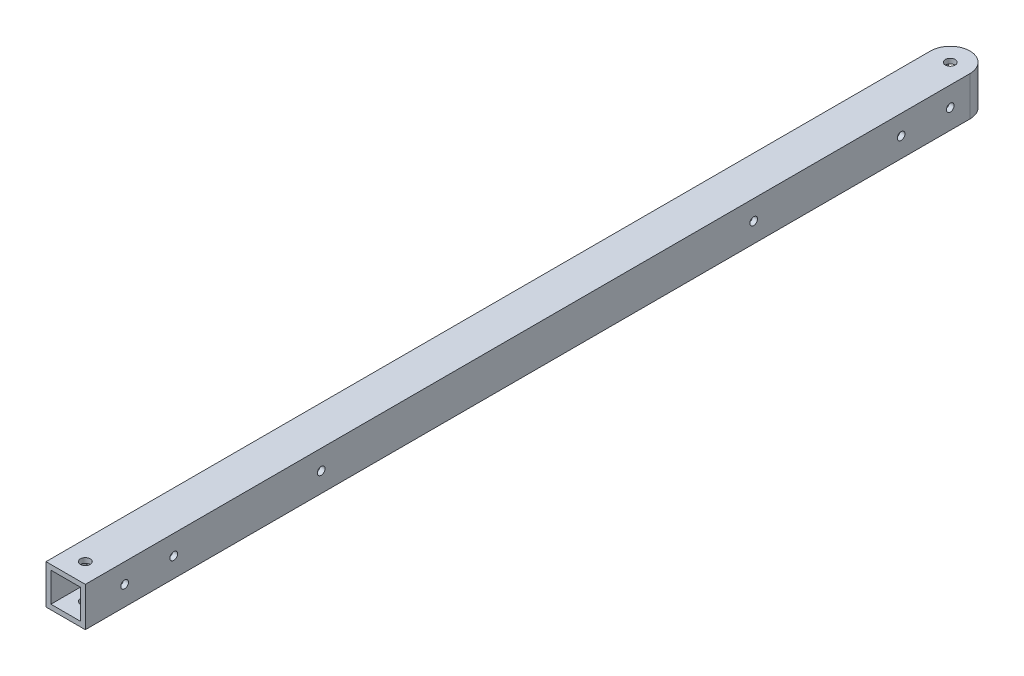
ISO-10303-21;
HEADER;
FILE_DESCRIPTION(('STEP AP214'),'2;1');
FILE_NAME('part.step','',(''),(''),'','','');
FILE_SCHEMA(('AUTOMOTIVE_DESIGN { 1 0 10303 214 1 1 1 1 }'));
ENDSEC;
DATA;
#1=APPLICATION_CONTEXT('core data for automotive mechanical design processes');
#2=APPLICATION_PROTOCOL_DEFINITION('international standard','automotive_design',2000,#1);
#3=PRODUCT_CONTEXT('',#1,'mechanical');
#4=PRODUCT('Part','Part','',(#3));
#5=PRODUCT_RELATED_PRODUCT_CATEGORY('part','',(#4));
#6=PRODUCT_DEFINITION_FORMATION('','',#4);
#7=PRODUCT_DEFINITION_CONTEXT('part definition',#1,'design');
#8=PRODUCT_DEFINITION('design','',#6,#7);
#9=PRODUCT_DEFINITION_SHAPE('','',#8);
#10=(LENGTH_UNIT() NAMED_UNIT(*) SI_UNIT(.MILLI.,.METRE.));
#11=(NAMED_UNIT(*) PLANE_ANGLE_UNIT() SI_UNIT($,.RADIAN.));
#12=(NAMED_UNIT(*) SI_UNIT($,.STERADIAN.) SOLID_ANGLE_UNIT());
#13=UNCERTAINTY_MEASURE_WITH_UNIT(LENGTH_MEASURE(1.E-05),#10,'distance_accuracy_value','');
#14=(GEOMETRIC_REPRESENTATION_CONTEXT(3) GLOBAL_UNCERTAINTY_ASSIGNED_CONTEXT((#13)) GLOBAL_UNIT_ASSIGNED_CONTEXT((#10,
#11,#12)) REPRESENTATION_CONTEXT('',''));
#15=CARTESIAN_POINT('',(0.,0.,0.));
#16=DIRECTION('',(0.,0.,1.));
#17=DIRECTION('',(1.,0.,0.));
#18=AXIS2_PLACEMENT_3D('',#15,#16,#17);
#19=CARTESIAN_POINT('',(12.7,-12.7,292.1));
#20=DIRECTION('',(-1.,0.,0.));
#21=DIRECTION('',(0.,0.,1.));
#22=AXIS2_PLACEMENT_3D('',#19,#20,#21);
#23=PLANE('',#22);
#24=CARTESIAN_POINT('',(12.7,0.,234.94999999939));
#25=DIRECTION('',(-1.,0.,0.));
#26=DIRECTION('',(0.,0.,1.));
#27=AXIS2_PLACEMENT_3D('',#24,#25,#26);
#28=CIRCLE('',#27,2.4892);
#29=CARTESIAN_POINT('',(12.7,0.,237.43919999939));
#30=VERTEX_POINT('',#29);
#31=EDGE_CURVE('E242',#30,#30,#28,.T.);
#32=ORIENTED_EDGE('',*,*,#31,.T.);
#33=EDGE_LOOP('',(#32));
#34=FACE_BOUND('',#33,.T.);
#35=CARTESIAN_POINT('',(12.7,0.,139.7));
#36=DIRECTION('',(-1.,0.,0.));
#37=DIRECTION('',(0.,0.,1.));
#38=AXIS2_PLACEMENT_3D('',#35,#36,#37);
#39=CIRCLE('',#38,2.4892);
#40=CARTESIAN_POINT('',(12.7,0.,142.1892));
#41=VERTEX_POINT('',#40);
#42=EDGE_CURVE('E236',#41,#41,#39,.T.);
#43=ORIENTED_EDGE('',*,*,#42,.T.);
#44=EDGE_LOOP('',(#43));
#45=FACE_BOUND('',#44,.T.);
#46=CARTESIAN_POINT('',(12.7,0.,266.7));
#47=DIRECTION('',(-1.,0.,0.));
#48=DIRECTION('',(0.,0.,1.));
#49=AXIS2_PLACEMENT_3D('',#46,#47,#48);
#50=CIRCLE('',#49,2.48920000000001);
#51=CARTESIAN_POINT('',(12.7,0.,269.1892));
#52=VERTEX_POINT('',#51);
#53=EDGE_CURVE('E153',#52,#52,#50,.T.);
#54=ORIENTED_EDGE('',*,*,#53,.T.);
#55=EDGE_LOOP('',(#54));
#56=FACE_BOUND('',#55,.T.);
#57=CARTESIAN_POINT('',(12.7,0.,-234.94999999939));
#58=DIRECTION('',(1.,0.,0.));
#59=DIRECTION('',(0.,0.,-1.));
#60=AXIS2_PLACEMENT_3D('',#57,#58,#59);
#61=CIRCLE('',#60,2.4892);
#62=CARTESIAN_POINT('',(12.7,0.,-237.43919999939));
#63=VERTEX_POINT('',#62);
#64=EDGE_CURVE('E219',#63,#63,#61,.T.);
#65=ORIENTED_EDGE('',*,*,#64,.F.);
#66=EDGE_LOOP('',(#65));
#67=FACE_BOUND('',#66,.T.);
#68=CARTESIAN_POINT('',(12.7,0.,-139.7));
#69=DIRECTION('',(1.,0.,0.));
#70=DIRECTION('',(0.,0.,-1.));
#71=AXIS2_PLACEMENT_3D('',#68,#69,#70);
#72=CIRCLE('',#71,2.4892);
#73=CARTESIAN_POINT('',(12.7,0.,-142.1892));
#74=VERTEX_POINT('',#73);
#75=EDGE_CURVE('E213',#74,#74,#72,.T.);
#76=ORIENTED_EDGE('',*,*,#75,.F.);
#77=EDGE_LOOP('',(#76));
#78=FACE_BOUND('',#77,.T.);
#79=CARTESIAN_POINT('',(12.7,0.,-266.7));
#80=DIRECTION('',(1.,0.,0.));
#81=DIRECTION('',(0.,0.,-1.));
#82=AXIS2_PLACEMENT_3D('',#79,#80,#81);
#83=CIRCLE('',#82,2.48920000000001);
#84=CARTESIAN_POINT('',(12.7,0.,-269.1892));
#85=VERTEX_POINT('',#84);
#86=EDGE_CURVE('E166',#85,#85,#83,.T.);
#87=ORIENTED_EDGE('',*,*,#86,.F.);
#88=EDGE_LOOP('',(#87));
#89=FACE_BOUND('',#88,.T.);
#90=DIRECTION('',(0.,-1.,0.));
#91=VECTOR('',#90,1.);
#92=CARTESIAN_POINT('',(12.7,12.7,-279.4));
#93=LINE('',#92,#91);
#94=CARTESIAN_POINT('',(12.7,12.7,-279.4));
#95=VERTEX_POINT('',#94);
#96=CARTESIAN_POINT('',(12.7,-12.7,-279.4));
#97=VERTEX_POINT('',#96);
#98=EDGE_CURVE('E124',#95,#97,#93,.T.);
#99=ORIENTED_EDGE('',*,*,#98,.F.);
#100=DIRECTION('',(0.,0.,-1.));
#101=VECTOR('',#100,1.);
#102=CARTESIAN_POINT('',(12.7,12.7,292.1));
#103=LINE('',#102,#101);
#104=CARTESIAN_POINT('',(12.7,12.7,292.1));
#105=VERTEX_POINT('',#104);
#106=EDGE_CURVE('E64',#105,#95,#103,.T.);
#107=ORIENTED_EDGE('',*,*,#106,.F.);
#108=DIRECTION('',(0.,1.,0.));
#109=VECTOR('',#108,1.);
#110=CARTESIAN_POINT('',(12.7,-12.7,292.1));
#111=LINE('',#110,#109);
#112=CARTESIAN_POINT('',(12.7,-12.7,292.1));
#113=VERTEX_POINT('',#112);
#114=EDGE_CURVE('E271',#113,#105,#111,.T.);
#115=ORIENTED_EDGE('',*,*,#114,.F.);
#116=DIRECTION('',(0.,0.,-1.));
#117=VECTOR('',#116,1.);
#118=CARTESIAN_POINT('',(12.7,-12.7,292.1));
#119=LINE('',#118,#117);
#120=EDGE_CURVE('E138',#113,#97,#119,.T.);
#121=ORIENTED_EDGE('',*,*,#120,.T.);
#122=EDGE_LOOP('',(#99,#107,#115,#121));
#123=FACE_BOUND('',#122,.T.);
#124=ADVANCED_FACE('F56',(#34,#45,#56,#67,#78,#89,#123),#23,.F.);
#125=CARTESIAN_POINT('',(-12.7,12.7,292.1));
#126=DIRECTION('',(0.,-1.,0.));
#127=DIRECTION('',(0.,0.,-1.));
#128=AXIS2_PLACEMENT_3D('',#125,#126,#127);
#129=PLANE('',#128);
#130=CARTESIAN_POINT('',(0.,12.7,-279.4));
#131=DIRECTION('',(0.,1.,0.));
#132=DIRECTION('',(0.,0.,1.));
#133=AXIS2_PLACEMENT_3D('',#130,#131,#132);
#134=CIRCLE('',#133,3.175);
#135=CARTESIAN_POINT('',(0.,12.7,-276.225));
#136=VERTEX_POINT('',#135);
#137=EDGE_CURVE('E183',#136,#136,#134,.T.);
#138=ORIENTED_EDGE('',*,*,#137,.F.);
#139=EDGE_LOOP('',(#138));
#140=FACE_BOUND('',#139,.T.);
#141=CARTESIAN_POINT('',(0.,12.7,279.4));
#142=DIRECTION('',(0.,1.,0.));
#143=DIRECTION('',(0.,0.,-1.));
#144=AXIS2_PLACEMENT_3D('',#141,#142,#143);
#145=CIRCLE('',#144,3.175);
#146=CARTESIAN_POINT('',(0.,12.7,276.225));
#147=VERTEX_POINT('',#146);
#148=EDGE_CURVE('E193',#147,#147,#145,.T.);
#149=ORIENTED_EDGE('',*,*,#148,.F.);
#150=EDGE_LOOP('',(#149));
#151=FACE_BOUND('',#150,.T.);
#152=ORIENTED_EDGE('',*,*,#106,.T.);
#153=CARTESIAN_POINT('',(0.,12.7,-279.4));
#154=DIRECTION('',(0.,-1.,0.));
#155=DIRECTION('',(0.,0.,-1.));
#156=AXIS2_PLACEMENT_3D('',#153,#154,#155);
#157=CIRCLE('',#156,12.7000000000001);
#158=CARTESIAN_POINT('',(-12.7,12.7,-279.4));
#159=VERTEX_POINT('',#158);
#160=EDGE_CURVE('E121',#159,#95,#157,.T.);
#161=ORIENTED_EDGE('',*,*,#160,.F.);
#162=DIRECTION('',(0.,0.,-1.));
#163=VECTOR('',#162,1.);
#164=CARTESIAN_POINT('',(-12.7,12.7,292.1));
#165=LINE('',#164,#163);
#166=CARTESIAN_POINT('',(-12.7,12.7,292.1));
#167=VERTEX_POINT('',#166);
#168=EDGE_CURVE('E143',#167,#159,#165,.T.);
#169=ORIENTED_EDGE('',*,*,#168,.F.);
#170=DIRECTION('',(-1.,0.,0.));
#171=VECTOR('',#170,1.);
#172=CARTESIAN_POINT('',(-12.7,12.7,292.1));
#173=LINE('',#172,#171);
#174=EDGE_CURVE('E141',#105,#167,#173,.T.);
#175=ORIENTED_EDGE('',*,*,#174,.F.);
#176=EDGE_LOOP('',(#152,#161,#169,#175));
#177=FACE_BOUND('',#176,.T.);
#178=ADVANCED_FACE('F140',(#140,#151,#177),#129,.F.);
#179=CARTESIAN_POINT('',(-12.7,-12.7,292.1));
#180=DIRECTION('',(0.,1.,0.));
#181=DIRECTION('',(0.,0.,1.));
#182=AXIS2_PLACEMENT_3D('',#179,#180,#181);
#183=PLANE('',#182);
#184=CARTESIAN_POINT('',(0.,-12.7,-279.4));
#185=DIRECTION('',(0.,1.,0.));
#186=DIRECTION('',(0.,0.,1.));
#187=AXIS2_PLACEMENT_3D('',#184,#185,#186);
#188=CIRCLE('',#187,3.175);
#189=CARTESIAN_POINT('',(0.,-12.7,-276.225));
#190=VERTEX_POINT('',#189);
#191=EDGE_CURVE('E177',#190,#190,#188,.T.);
#192=ORIENTED_EDGE('',*,*,#191,.T.);
#193=EDGE_LOOP('',(#192));
#194=FACE_BOUND('',#193,.T.);
#195=CARTESIAN_POINT('',(0.,-12.7,279.4));
#196=DIRECTION('',(0.,1.,0.));
#197=DIRECTION('',(0.,0.,-1.));
#198=AXIS2_PLACEMENT_3D('',#195,#196,#197);
#199=CIRCLE('',#198,3.175);
#200=CARTESIAN_POINT('',(0.,-12.7,276.225));
#201=VERTEX_POINT('',#200);
#202=EDGE_CURVE('E188',#201,#201,#199,.T.);
#203=ORIENTED_EDGE('',*,*,#202,.T.);
#204=EDGE_LOOP('',(#203));
#205=FACE_BOUND('',#204,.T.);
#206=CARTESIAN_POINT('',(0.,-12.7,-279.4));
#207=DIRECTION('',(0.,-1.,0.));
#208=DIRECTION('',(0.,0.,-1.));
#209=AXIS2_PLACEMENT_3D('',#206,#207,#208);
#210=CIRCLE('',#209,12.7000000000001);
#211=CARTESIAN_POINT('',(-12.7,-12.7,-279.4));
#212=VERTEX_POINT('',#211);
#213=EDGE_CURVE('E132',#212,#97,#210,.T.);
#214=ORIENTED_EDGE('',*,*,#213,.T.);
#215=ORIENTED_EDGE('',*,*,#120,.F.);
#216=DIRECTION('',(1.,0.,0.));
#217=VECTOR('',#216,1.);
#218=CARTESIAN_POINT('',(-12.7,-12.7,292.1));
#219=LINE('',#218,#217);
#220=CARTESIAN_POINT('',(-12.7,-12.7,292.1));
#221=VERTEX_POINT('',#220);
#222=EDGE_CURVE('E276',#221,#113,#219,.T.);
#223=ORIENTED_EDGE('',*,*,#222,.F.);
#224=DIRECTION('',(0.,0.,-1.));
#225=VECTOR('',#224,1.);
#226=CARTESIAN_POINT('',(-12.7,-12.7,292.1));
#227=LINE('',#226,#225);
#228=EDGE_CURVE('E145',#221,#212,#227,.T.);
#229=ORIENTED_EDGE('',*,*,#228,.T.);
#230=EDGE_LOOP('',(#214,#215,#223,#229));
#231=FACE_BOUND('',#230,.T.);
#232=ADVANCED_FACE('F282',(#194,#205,#231),#183,.F.);
#233=CARTESIAN_POINT('',(9.525,0.,292.1));
#234=DIRECTION('',(-1.,0.,0.));
#235=DIRECTION('',(0.,0.,1.));
#236=AXIS2_PLACEMENT_3D('',#233,#234,#235);
#237=PLANE('',#236);
#238=CARTESIAN_POINT('',(9.525,0.,-266.7));
#239=DIRECTION('',(-1.,0.,0.));
#240=DIRECTION('',(0.,0.,1.));
#241=AXIS2_PLACEMENT_3D('',#238,#239,#240);
#242=CIRCLE('',#241,2.48920000000001);
#243=CARTESIAN_POINT('',(9.525,0.,-264.2108));
#244=VERTEX_POINT('',#243);
#245=EDGE_CURVE('E173',#244,#244,#242,.F.);
#246=ORIENTED_EDGE('',*,*,#245,.T.);
#247=EDGE_LOOP('',(#246));
#248=FACE_BOUND('',#247,.T.);
#249=CARTESIAN_POINT('',(9.525,0.,-139.7));
#250=DIRECTION('',(-1.,0.,0.));
#251=DIRECTION('',(0.,0.,1.));
#252=AXIS2_PLACEMENT_3D('',#249,#250,#251);
#253=CIRCLE('',#252,2.4892);
#254=CARTESIAN_POINT('',(9.525,0.,-137.2108));
#255=VERTEX_POINT('',#254);
#256=EDGE_CURVE('E170',#255,#255,#253,.F.);
#257=ORIENTED_EDGE('',*,*,#256,.T.);
#258=EDGE_LOOP('',(#257));
#259=FACE_BOUND('',#258,.T.);
#260=CARTESIAN_POINT('',(9.525,0.,-234.94999999939));
#261=DIRECTION('',(-1.,0.,0.));
#262=DIRECTION('',(0.,0.,1.));
#263=AXIS2_PLACEMENT_3D('',#260,#261,#262);
#264=CIRCLE('',#263,2.4892);
#265=CARTESIAN_POINT('',(9.525,0.,-232.46079999939));
#266=VERTEX_POINT('',#265);
#267=EDGE_CURVE('E165',#266,#266,#264,.F.);
#268=ORIENTED_EDGE('',*,*,#267,.T.);
#269=EDGE_LOOP('',(#268));
#270=FACE_BOUND('',#269,.T.);
#271=CARTESIAN_POINT('',(9.525,0.,266.7));
#272=DIRECTION('',(-1.,0.,0.));
#273=DIRECTION('',(0.,0.,1.));
#274=AXIS2_PLACEMENT_3D('',#271,#272,#273);
#275=CIRCLE('',#274,2.48920000000001);
#276=CARTESIAN_POINT('',(9.525,0.,269.1892));
#277=VERTEX_POINT('',#276);
#278=EDGE_CURVE('E161',#277,#277,#275,.T.);
#279=ORIENTED_EDGE('',*,*,#278,.F.);
#280=EDGE_LOOP('',(#279));
#281=FACE_BOUND('',#280,.T.);
#282=CARTESIAN_POINT('',(9.525,0.,139.7));
#283=DIRECTION('',(-1.,0.,0.));
#284=DIRECTION('',(0.,0.,1.));
#285=AXIS2_PLACEMENT_3D('',#282,#283,#284);
#286=CIRCLE('',#285,2.4892);
#287=CARTESIAN_POINT('',(9.525,0.,142.1892));
#288=VERTEX_POINT('',#287);
#289=EDGE_CURVE('E157',#288,#288,#286,.T.);
#290=ORIENTED_EDGE('',*,*,#289,.F.);
#291=EDGE_LOOP('',(#290));
#292=FACE_BOUND('',#291,.T.);
#293=CARTESIAN_POINT('',(9.525,0.,234.94999999939));
#294=DIRECTION('',(-1.,0.,0.));
#295=DIRECTION('',(0.,0.,1.));
#296=AXIS2_PLACEMENT_3D('',#293,#294,#295);
#297=CIRCLE('',#296,2.4892);
#298=CARTESIAN_POINT('',(9.525,0.,237.43919999939));
#299=VERTEX_POINT('',#298);
#300=EDGE_CURVE('E152',#299,#299,#297,.T.);
#301=ORIENTED_EDGE('',*,*,#300,.F.);
#302=EDGE_LOOP('',(#301));
#303=FACE_BOUND('',#302,.T.);
#304=DIRECTION('',(0.,0.,-1.));
#305=VECTOR('',#304,1.);
#306=CARTESIAN_POINT('',(9.525,9.525,292.1));
#307=LINE('',#306,#305);
#308=CARTESIAN_POINT('',(9.525,9.525,292.1));
#309=VERTEX_POINT('',#308);
#310=CARTESIAN_POINT('',(9.525,9.525,-287.80026041263));
#311=VERTEX_POINT('',#310);
#312=EDGE_CURVE('E268',#309,#311,#307,.T.);
#313=ORIENTED_EDGE('',*,*,#312,.T.);
#314=DIRECTION('',(0.,-1.,0.));
#315=VECTOR('',#314,1.);
#316=CARTESIAN_POINT('',(9.525,12.7,-287.80026041263));
#317=LINE('',#316,#315);
#318=CARTESIAN_POINT('',(9.525,-9.525,-287.80026041263));
#319=VERTEX_POINT('',#318);
#320=EDGE_CURVE('E204',#311,#319,#317,.T.);
#321=ORIENTED_EDGE('',*,*,#320,.T.);
#322=DIRECTION('',(0.,0.,-1.));
#323=VECTOR('',#322,1.);
#324=CARTESIAN_POINT('',(9.525,-9.525,292.1));
#325=LINE('',#324,#323);
#326=CARTESIAN_POINT('',(9.525,-9.525,292.1));
#327=VERTEX_POINT('',#326);
#328=EDGE_CURVE('E261',#327,#319,#325,.T.);
#329=ORIENTED_EDGE('',*,*,#328,.F.);
#330=DIRECTION('',(0.,1.,0.));
#331=VECTOR('',#330,1.);
#332=CARTESIAN_POINT('',(9.525,0.,292.1));
#333=LINE('',#332,#331);
#334=EDGE_CURVE('E253',#327,#309,#333,.T.);
#335=ORIENTED_EDGE('',*,*,#334,.T.);
#336=EDGE_LOOP('',(#313,#321,#329,#335));
#337=FACE_BOUND('',#336,.T.);
#338=ADVANCED_FACE('F304',(#248,#259,#270,#281,#292,#303,#337),#237,.T.);
#339=CARTESIAN_POINT('',(0.,9.525,292.1));
#340=DIRECTION('',(0.,-1.,0.));
#341=DIRECTION('',(0.,0.,-1.));
#342=AXIS2_PLACEMENT_3D('',#339,#340,#341);
#343=PLANE('',#342);
#344=CARTESIAN_POINT('',(0.,9.525,-279.4));
#345=DIRECTION('',(0.,-1.,0.));
#346=DIRECTION('',(0.,0.,-1.));
#347=AXIS2_PLACEMENT_3D('',#344,#345,#346);
#348=CIRCLE('',#347,3.175);
#349=CARTESIAN_POINT('',(0.,9.525,-282.575));
#350=VERTEX_POINT('',#349);
#351=EDGE_CURVE('E196',#350,#350,#348,.T.);
#352=ORIENTED_EDGE('',*,*,#351,.F.);
#353=EDGE_LOOP('',(#352));
#354=FACE_BOUND('',#353,.T.);
#355=CARTESIAN_POINT('',(0.,9.525,279.4));
#356=DIRECTION('',(0.,-1.,0.));
#357=DIRECTION('',(0.,0.,-1.));
#358=AXIS2_PLACEMENT_3D('',#355,#356,#357);
#359=CIRCLE('',#358,3.175);
#360=CARTESIAN_POINT('',(0.,9.525,276.225));
#361=VERTEX_POINT('',#360);
#362=EDGE_CURVE('E176',#361,#361,#359,.T.);
#363=ORIENTED_EDGE('',*,*,#362,.F.);
#364=EDGE_LOOP('',(#363));
#365=FACE_BOUND('',#364,.T.);
#366=CARTESIAN_POINT('',(0.,9.525,-279.4));
#367=DIRECTION('',(0.,-1.,0.));
#368=DIRECTION('',(0.,0.,-1.));
#369=AXIS2_PLACEMENT_3D('',#366,#367,#368);
#370=CIRCLE('',#369,12.7000000000001);
#371=CARTESIAN_POINT('',(-9.52500000000001,9.525,-287.80026041263));
#372=VERTEX_POINT('',#371);
#373=EDGE_CURVE('E202',#372,#311,#370,.T.);
#374=ORIENTED_EDGE('',*,*,#373,.T.);
#375=ORIENTED_EDGE('',*,*,#312,.F.);
#376=DIRECTION('',(-1.,0.,0.));
#377=VECTOR('',#376,1.);
#378=CARTESIAN_POINT('',(0.,9.525,292.1));
#379=LINE('',#378,#377);
#380=CARTESIAN_POINT('',(-9.52500000000001,9.525,292.1));
#381=VERTEX_POINT('',#380);
#382=EDGE_CURVE('E255',#309,#381,#379,.T.);
#383=ORIENTED_EDGE('',*,*,#382,.T.);
#384=DIRECTION('',(0.,0.,-1.));
#385=VECTOR('',#384,1.);
#386=CARTESIAN_POINT('',(-9.52500000000001,9.525,292.1));
#387=LINE('',#386,#385);
#388=EDGE_CURVE('E265',#381,#372,#387,.T.);
#389=ORIENTED_EDGE('',*,*,#388,.T.);
#390=EDGE_LOOP('',(#374,#375,#383,#389));
#391=FACE_BOUND('',#390,.T.);
#392=ADVANCED_FACE('F299',(#354,#365,#391),#343,.T.);
#393=CARTESIAN_POINT('',(-9.52500000000001,0.,292.1));
#394=DIRECTION('',(1.,0.,0.));
#395=DIRECTION('',(0.,0.,-1.));
#396=AXIS2_PLACEMENT_3D('',#393,#394,#395);
#397=PLANE('',#396);
#398=CARTESIAN_POINT('',(-9.52500000000001,0.,-266.7));
#399=DIRECTION('',(1.,0.,0.));
#400=DIRECTION('',(0.,0.,-1.));
#401=AXIS2_PLACEMENT_3D('',#398,#399,#400);
#402=CIRCLE('',#401,2.48920000000001);
#403=CARTESIAN_POINT('',(-9.52500000000001,0.,-269.1892));
#404=VERTEX_POINT('',#403);
#405=EDGE_CURVE('E171',#404,#404,#402,.F.);
#406=ORIENTED_EDGE('',*,*,#405,.T.);
#407=EDGE_LOOP('',(#406));
#408=FACE_BOUND('',#407,.T.);
#409=CARTESIAN_POINT('',(-9.52500000000001,0.,-139.7));
#410=DIRECTION('',(1.,0.,0.));
#411=DIRECTION('',(0.,0.,-1.));
#412=AXIS2_PLACEMENT_3D('',#409,#410,#411);
#413=CIRCLE('',#412,2.4892);
#414=CARTESIAN_POINT('',(-9.52500000000001,0.,-142.1892));
#415=VERTEX_POINT('',#414);
#416=EDGE_CURVE('E167',#415,#415,#413,.F.);
#417=ORIENTED_EDGE('',*,*,#416,.T.);
#418=EDGE_LOOP('',(#417));
#419=FACE_BOUND('',#418,.T.);
#420=CARTESIAN_POINT('',(-9.52500000000001,0.,-234.94999999939));
#421=DIRECTION('',(1.,0.,0.));
#422=DIRECTION('',(0.,0.,-1.));
#423=AXIS2_PLACEMENT_3D('',#420,#421,#422);
#424=CIRCLE('',#423,2.4892);
#425=CARTESIAN_POINT('',(-9.52500000000001,0.,-237.43919999939));
#426=VERTEX_POINT('',#425);
#427=EDGE_CURVE('E162',#426,#426,#424,.F.);
#428=ORIENTED_EDGE('',*,*,#427,.T.);
#429=EDGE_LOOP('',(#428));
#430=FACE_BOUND('',#429,.T.);
#431=CARTESIAN_POINT('',(-9.52500000000001,0.,266.7));
#432=DIRECTION('',(1.,0.,0.));
#433=DIRECTION('',(0.,0.,-1.));
#434=AXIS2_PLACEMENT_3D('',#431,#432,#433);
#435=CIRCLE('',#434,2.48920000000001);
#436=CARTESIAN_POINT('',(-9.52500000000001,0.,264.2108));
#437=VERTEX_POINT('',#436);
#438=EDGE_CURVE('E158',#437,#437,#435,.T.);
#439=ORIENTED_EDGE('',*,*,#438,.F.);
#440=EDGE_LOOP('',(#439));
#441=FACE_BOUND('',#440,.T.);
#442=CARTESIAN_POINT('',(-9.52500000000001,0.,139.7));
#443=DIRECTION('',(1.,0.,0.));
#444=DIRECTION('',(0.,0.,-1.));
#445=AXIS2_PLACEMENT_3D('',#442,#443,#444);
#446=CIRCLE('',#445,2.4892);
#447=CARTESIAN_POINT('',(-9.52500000000001,0.,137.2108));
#448=VERTEX_POINT('',#447);
#449=EDGE_CURVE('E154',#448,#448,#446,.T.);
#450=ORIENTED_EDGE('',*,*,#449,.F.);
#451=EDGE_LOOP('',(#450));
#452=FACE_BOUND('',#451,.T.);
#453=CARTESIAN_POINT('',(-9.52500000000001,0.,234.94999999939));
#454=DIRECTION('',(1.,0.,0.));
#455=DIRECTION('',(0.,0.,-1.));
#456=AXIS2_PLACEMENT_3D('',#453,#454,#455);
#457=CIRCLE('',#456,2.4892);
#458=CARTESIAN_POINT('',(-9.52500000000001,0.,232.46079999939));
#459=VERTEX_POINT('',#458);
#460=EDGE_CURVE('E149',#459,#459,#457,.T.);
#461=ORIENTED_EDGE('',*,*,#460,.F.);
#462=EDGE_LOOP('',(#461));
#463=FACE_BOUND('',#462,.T.);
#464=DIRECTION('',(0.,0.,-1.));
#465=VECTOR('',#464,1.);
#466=CARTESIAN_POINT('',(-9.52500000000001,-9.525,292.1));
#467=LINE('',#466,#465);
#468=CARTESIAN_POINT('',(-9.52500000000001,-9.525,292.1));
#469=VERTEX_POINT('',#468);
#470=CARTESIAN_POINT('',(-9.52500000000001,-9.525,-287.80026041263));
#471=VERTEX_POINT('',#470);
#472=EDGE_CURVE('E78',#469,#471,#467,.T.);
#473=ORIENTED_EDGE('',*,*,#472,.T.);
#474=DIRECTION('',(0.,-1.,0.));
#475=VECTOR('',#474,1.);
#476=CARTESIAN_POINT('',(-9.52500000000001,12.7,-287.80026041263));
#477=LINE('',#476,#475);
#478=EDGE_CURVE('E72',#471,#372,#477,.F.);
#479=ORIENTED_EDGE('',*,*,#478,.T.);
#480=ORIENTED_EDGE('',*,*,#388,.F.);
#481=DIRECTION('',(0.,-1.,0.));
#482=VECTOR('',#481,1.);
#483=CARTESIAN_POINT('',(-9.52500000000001,0.,292.1));
#484=LINE('',#483,#482);
#485=EDGE_CURVE('E257',#381,#469,#484,.T.);
#486=ORIENTED_EDGE('',*,*,#485,.T.);
#487=EDGE_LOOP('',(#473,#479,#480,#486));
#488=FACE_BOUND('',#487,.T.);
#489=ADVANCED_FACE('F301',(#408,#419,#430,#441,#452,#463,#488),#397,.T.);
#490=CARTESIAN_POINT('',(0.,-9.525,292.1));
#491=DIRECTION('',(0.,1.,0.));
#492=DIRECTION('',(0.,0.,1.));
#493=AXIS2_PLACEMENT_3D('',#490,#491,#492);
#494=PLANE('',#493);
#495=CARTESIAN_POINT('',(0.,-9.525,-279.4));
#496=DIRECTION('',(0.,1.,0.));
#497=DIRECTION('',(0.,0.,1.));
#498=AXIS2_PLACEMENT_3D('',#495,#496,#497);
#499=CIRCLE('',#498,3.175);
#500=CARTESIAN_POINT('',(0.,-9.525,-276.225));
#501=VERTEX_POINT('',#500);
#502=EDGE_CURVE('E59',#501,#501,#499,.T.);
#503=ORIENTED_EDGE('',*,*,#502,.F.);
#504=EDGE_LOOP('',(#503));
#505=FACE_BOUND('',#504,.T.);
#506=CARTESIAN_POINT('',(0.,-9.525,279.4));
#507=DIRECTION('',(0.,1.,0.));
#508=DIRECTION('',(0.,0.,1.));
#509=AXIS2_PLACEMENT_3D('',#506,#507,#508);
#510=CIRCLE('',#509,3.175);
#511=CARTESIAN_POINT('',(0.,-9.525,282.575));
#512=VERTEX_POINT('',#511);
#513=EDGE_CURVE('E174',#512,#512,#510,.T.);
#514=ORIENTED_EDGE('',*,*,#513,.F.);
#515=EDGE_LOOP('',(#514));
#516=FACE_BOUND('',#515,.T.);
#517=ORIENTED_EDGE('',*,*,#328,.T.);
#518=CARTESIAN_POINT('',(0.,-9.525,-279.4));
#519=DIRECTION('',(0.,1.,0.));
#520=DIRECTION('',(0.,0.,1.));
#521=AXIS2_PLACEMENT_3D('',#518,#519,#520);
#522=CIRCLE('',#521,12.7000000000001);
#523=EDGE_CURVE('E12',#319,#471,#522,.T.);
#524=ORIENTED_EDGE('',*,*,#523,.T.);
#525=ORIENTED_EDGE('',*,*,#472,.F.);
#526=DIRECTION('',(1.,0.,0.));
#527=VECTOR('',#526,1.);
#528=CARTESIAN_POINT('',(0.,-9.525,292.1));
#529=LINE('',#528,#527);
#530=EDGE_CURVE('E259',#469,#327,#529,.T.);
#531=ORIENTED_EDGE('',*,*,#530,.T.);
#532=EDGE_LOOP('',(#517,#524,#525,#531));
#533=FACE_BOUND('',#532,.T.);
#534=ADVANCED_FACE('F290',(#505,#516,#533),#494,.T.);
#535=CARTESIAN_POINT('',(0.,0.,292.1));
#536=DIRECTION('',(0.,0.,1.));
#537=DIRECTION('',(1.,0.,0.));
#538=AXIS2_PLACEMENT_3D('',#535,#536,#537);
#539=PLANE('',#538);
#540=ORIENTED_EDGE('',*,*,#114,.T.);
#541=ORIENTED_EDGE('',*,*,#174,.T.);
#542=DIRECTION('',(0.,-1.,0.));
#543=VECTOR('',#542,1.);
#544=CARTESIAN_POINT('',(-12.7,-12.7,292.1));
#545=LINE('',#544,#543);
#546=EDGE_CURVE('E274',#167,#221,#545,.T.);
#547=ORIENTED_EDGE('',*,*,#546,.T.);
#548=ORIENTED_EDGE('',*,*,#222,.T.);
#549=EDGE_LOOP('',(#540,#541,#547,#548));
#550=FACE_BOUND('',#549,.T.);
#551=ORIENTED_EDGE('',*,*,#382,.F.);
#552=ORIENTED_EDGE('',*,*,#334,.F.);
#553=ORIENTED_EDGE('',*,*,#530,.F.);
#554=ORIENTED_EDGE('',*,*,#485,.F.);
#555=EDGE_LOOP('',(#551,#552,#553,#554));
#556=FACE_BOUND('',#555,.T.);
#557=ADVANCED_FACE('F287',(#550,#556),#539,.T.);
#558=CARTESIAN_POINT('',(-12.7,-12.7,292.1));
#559=DIRECTION('',(1.,0.,0.));
#560=DIRECTION('',(0.,0.,-1.));
#561=AXIS2_PLACEMENT_3D('',#558,#559,#560);
#562=PLANE('',#561);
#563=CARTESIAN_POINT('',(-12.7,0.,-266.7));
#564=DIRECTION('',(1.,0.,0.));
#565=DIRECTION('',(0.,0.,-1.));
#566=AXIS2_PLACEMENT_3D('',#563,#564,#565);
#567=CIRCLE('',#566,2.48920000000001);
#568=CARTESIAN_POINT('',(-12.7,0.,-269.1892));
#569=VERTEX_POINT('',#568);
#570=EDGE_CURVE('E210',#569,#569,#567,.T.);
#571=ORIENTED_EDGE('',*,*,#570,.T.);
#572=EDGE_LOOP('',(#571));
#573=FACE_BOUND('',#572,.T.);
#574=CARTESIAN_POINT('',(-12.7,0.,-139.7));
#575=DIRECTION('',(1.,0.,0.));
#576=DIRECTION('',(0.,0.,-1.));
#577=AXIS2_PLACEMENT_3D('',#574,#575,#576);
#578=CIRCLE('',#577,2.4892);
#579=CARTESIAN_POINT('',(-12.7,0.,-142.1892));
#580=VERTEX_POINT('',#579);
#581=EDGE_CURVE('E216',#580,#580,#578,.T.);
#582=ORIENTED_EDGE('',*,*,#581,.T.);
#583=EDGE_LOOP('',(#582));
#584=FACE_BOUND('',#583,.T.);
#585=CARTESIAN_POINT('',(-12.7,0.,-234.94999999939));
#586=DIRECTION('',(1.,0.,0.));
#587=DIRECTION('',(0.,0.,-1.));
#588=AXIS2_PLACEMENT_3D('',#585,#586,#587);
#589=CIRCLE('',#588,2.4892);
#590=CARTESIAN_POINT('',(-12.7,0.,-237.43919999939));
#591=VERTEX_POINT('',#590);
#592=EDGE_CURVE('E207',#591,#591,#589,.T.);
#593=ORIENTED_EDGE('',*,*,#592,.T.);
#594=EDGE_LOOP('',(#593));
#595=FACE_BOUND('',#594,.T.);
#596=CARTESIAN_POINT('',(-12.7,0.,266.7));
#597=DIRECTION('',(-1.,0.,0.));
#598=DIRECTION('',(0.,0.,1.));
#599=AXIS2_PLACEMENT_3D('',#596,#597,#598);
#600=CIRCLE('',#599,2.48920000000001);
#601=CARTESIAN_POINT('',(-12.7,0.,269.1892));
#602=VERTEX_POINT('',#601);
#603=EDGE_CURVE('E233',#602,#602,#600,.T.);
#604=ORIENTED_EDGE('',*,*,#603,.F.);
#605=EDGE_LOOP('',(#604));
#606=FACE_BOUND('',#605,.T.);
#607=CARTESIAN_POINT('',(-12.7,0.,139.7));
#608=DIRECTION('',(-1.,0.,0.));
#609=DIRECTION('',(0.,0.,1.));
#610=AXIS2_PLACEMENT_3D('',#607,#608,#609);
#611=CIRCLE('',#610,2.4892);
#612=CARTESIAN_POINT('',(-12.7,0.,142.1892));
#613=VERTEX_POINT('',#612);
#614=EDGE_CURVE('E239',#613,#613,#611,.T.);
#615=ORIENTED_EDGE('',*,*,#614,.F.);
#616=EDGE_LOOP('',(#615));
#617=FACE_BOUND('',#616,.T.);
#618=CARTESIAN_POINT('',(-12.7,0.,234.94999999939));
#619=DIRECTION('',(-1.,0.,0.));
#620=DIRECTION('',(0.,0.,1.));
#621=AXIS2_PLACEMENT_3D('',#618,#619,#620);
#622=CIRCLE('',#621,2.4892);
#623=CARTESIAN_POINT('',(-12.7,0.,237.43919999939));
#624=VERTEX_POINT('',#623);
#625=EDGE_CURVE('E230',#624,#624,#622,.T.);
#626=ORIENTED_EDGE('',*,*,#625,.F.);
#627=EDGE_LOOP('',(#626));
#628=FACE_BOUND('',#627,.T.);
#629=ORIENTED_EDGE('',*,*,#168,.T.);
#630=DIRECTION('',(0.,-1.,0.));
#631=VECTOR('',#630,1.);
#632=CARTESIAN_POINT('',(-12.7,12.7,-279.4));
#633=LINE('',#632,#631);
#634=EDGE_CURVE('E127',#159,#212,#633,.T.);
#635=ORIENTED_EDGE('',*,*,#634,.T.);
#636=ORIENTED_EDGE('',*,*,#228,.F.);
#637=ORIENTED_EDGE('',*,*,#546,.F.);
#638=EDGE_LOOP('',(#629,#635,#636,#637));
#639=FACE_BOUND('',#638,.T.);
#640=ADVANCED_FACE('F285',(#573,#584,#595,#606,#617,#628,#639),#562,.F.);
#641=CARTESIAN_POINT('',(12.7,0.,234.94999999939));
#642=DIRECTION('',(-1.,0.,0.));
#643=DIRECTION('',(0.,0.,1.));
#644=AXIS2_PLACEMENT_3D('',#641,#642,#643);
#645=CYLINDRICAL_SURFACE('',#644,2.4892);
#646=ORIENTED_EDGE('',*,*,#460,.T.);
#647=EDGE_LOOP('',(#646));
#648=FACE_BOUND('',#647,.T.);
#649=ORIENTED_EDGE('',*,*,#625,.T.);
#650=EDGE_LOOP('',(#649));
#651=FACE_BOUND('',#650,.T.);
#652=ADVANCED_FACE('F367',(#648,#651),#645,.F.);
#653=CARTESIAN_POINT('',(12.7,0.,139.7));
#654=DIRECTION('',(-1.,0.,0.));
#655=DIRECTION('',(0.,0.,1.));
#656=AXIS2_PLACEMENT_3D('',#653,#654,#655);
#657=CYLINDRICAL_SURFACE('',#656,2.4892);
#658=ORIENTED_EDGE('',*,*,#449,.T.);
#659=EDGE_LOOP('',(#658));
#660=FACE_BOUND('',#659,.T.);
#661=ORIENTED_EDGE('',*,*,#614,.T.);
#662=EDGE_LOOP('',(#661));
#663=FACE_BOUND('',#662,.T.);
#664=ADVANCED_FACE('F379',(#660,#663),#657,.F.);
#665=CARTESIAN_POINT('',(12.7,0.,266.7));
#666=DIRECTION('',(-1.,0.,0.));
#667=DIRECTION('',(0.,0.,1.));
#668=AXIS2_PLACEMENT_3D('',#665,#666,#667);
#669=CYLINDRICAL_SURFACE('',#668,2.48920000000001);
#670=ORIENTED_EDGE('',*,*,#438,.T.);
#671=EDGE_LOOP('',(#670));
#672=FACE_BOUND('',#671,.T.);
#673=ORIENTED_EDGE('',*,*,#603,.T.);
#674=EDGE_LOOP('',(#673));
#675=FACE_BOUND('',#674,.T.);
#676=ADVANCED_FACE('F386',(#672,#675),#669,.F.);
#677=ORIENTED_EDGE('',*,*,#300,.T.);
#678=EDGE_LOOP('',(#677));
#679=FACE_BOUND('',#678,.T.);
#680=ORIENTED_EDGE('',*,*,#31,.F.);
#681=EDGE_LOOP('',(#680));
#682=FACE_BOUND('',#681,.T.);
#683=ADVANCED_FACE('F382',(#679,#682),#645,.F.);
#684=ORIENTED_EDGE('',*,*,#289,.T.);
#685=EDGE_LOOP('',(#684));
#686=FACE_BOUND('',#685,.T.);
#687=ORIENTED_EDGE('',*,*,#42,.F.);
#688=EDGE_LOOP('',(#687));
#689=FACE_BOUND('',#688,.T.);
#690=ADVANCED_FACE('F389',(#686,#689),#657,.F.);
#691=ORIENTED_EDGE('',*,*,#278,.T.);
#692=EDGE_LOOP('',(#691));
#693=FACE_BOUND('',#692,.T.);
#694=ORIENTED_EDGE('',*,*,#53,.F.);
#695=EDGE_LOOP('',(#694));
#696=FACE_BOUND('',#695,.T.);
#697=ADVANCED_FACE('F359',(#693,#696),#669,.F.);
#698=CARTESIAN_POINT('',(12.7,0.,-234.94999999939));
#699=DIRECTION('',(-1.,0.,0.));
#700=DIRECTION('',(0.,0.,1.));
#701=AXIS2_PLACEMENT_3D('',#698,#699,#700);
#702=CYLINDRICAL_SURFACE('',#701,2.4892);
#703=ORIENTED_EDGE('',*,*,#427,.F.);
#704=EDGE_LOOP('',(#703));
#705=FACE_BOUND('',#704,.T.);
#706=ORIENTED_EDGE('',*,*,#592,.F.);
#707=EDGE_LOOP('',(#706));
#708=FACE_BOUND('',#707,.T.);
#709=ADVANCED_FACE('F350',(#705,#708),#702,.F.);
#710=CARTESIAN_POINT('',(12.7,0.,-139.7));
#711=DIRECTION('',(-1.,0.,0.));
#712=DIRECTION('',(0.,0.,1.));
#713=AXIS2_PLACEMENT_3D('',#710,#711,#712);
#714=CYLINDRICAL_SURFACE('',#713,2.4892);
#715=ORIENTED_EDGE('',*,*,#416,.F.);
#716=EDGE_LOOP('',(#715));
#717=FACE_BOUND('',#716,.T.);
#718=ORIENTED_EDGE('',*,*,#581,.F.);
#719=EDGE_LOOP('',(#718));
#720=FACE_BOUND('',#719,.T.);
#721=ADVANCED_FACE('F344',(#717,#720),#714,.F.);
#722=CARTESIAN_POINT('',(12.7,0.,-266.7));
#723=DIRECTION('',(-1.,0.,0.));
#724=DIRECTION('',(0.,0.,1.));
#725=AXIS2_PLACEMENT_3D('',#722,#723,#724);
#726=CYLINDRICAL_SURFACE('',#725,2.48920000000001);
#727=ORIENTED_EDGE('',*,*,#405,.F.);
#728=EDGE_LOOP('',(#727));
#729=FACE_BOUND('',#728,.T.);
#730=ORIENTED_EDGE('',*,*,#570,.F.);
#731=EDGE_LOOP('',(#730));
#732=FACE_BOUND('',#731,.T.);
#733=ADVANCED_FACE('F320',(#729,#732),#726,.F.);
#734=ORIENTED_EDGE('',*,*,#267,.F.);
#735=EDGE_LOOP('',(#734));
#736=FACE_BOUND('',#735,.T.);
#737=ORIENTED_EDGE('',*,*,#64,.T.);
#738=EDGE_LOOP('',(#737));
#739=FACE_BOUND('',#738,.T.);
#740=ADVANCED_FACE('F341',(#736,#739),#702,.F.);
#741=ORIENTED_EDGE('',*,*,#256,.F.);
#742=EDGE_LOOP('',(#741));
#743=FACE_BOUND('',#742,.T.);
#744=ORIENTED_EDGE('',*,*,#75,.T.);
#745=EDGE_LOOP('',(#744));
#746=FACE_BOUND('',#745,.T.);
#747=ADVANCED_FACE('F317',(#743,#746),#714,.F.);
#748=ORIENTED_EDGE('',*,*,#245,.F.);
#749=EDGE_LOOP('',(#748));
#750=FACE_BOUND('',#749,.T.);
#751=ORIENTED_EDGE('',*,*,#86,.T.);
#752=EDGE_LOOP('',(#751));
#753=FACE_BOUND('',#752,.T.);
#754=ADVANCED_FACE('F308',(#750,#753),#726,.F.);
#755=CARTESIAN_POINT('',(0.,12.7,-279.4));
#756=DIRECTION('',(0.,-1.,0.));
#757=DIRECTION('',(0.,0.,-1.));
#758=AXIS2_PLACEMENT_3D('',#755,#756,#757);
#759=CYLINDRICAL_SURFACE('',#758,12.7000000000001);
#760=ORIENTED_EDGE('',*,*,#320,.F.);
#761=ORIENTED_EDGE('',*,*,#373,.F.);
#762=ORIENTED_EDGE('',*,*,#478,.F.);
#763=ORIENTED_EDGE('',*,*,#523,.F.);
#764=EDGE_LOOP('',(#760,#761,#762,#763));
#765=FACE_BOUND('',#764,.T.);
#766=ORIENTED_EDGE('',*,*,#160,.T.);
#767=ORIENTED_EDGE('',*,*,#98,.T.);
#768=ORIENTED_EDGE('',*,*,#213,.F.);
#769=ORIENTED_EDGE('',*,*,#634,.F.);
#770=EDGE_LOOP('',(#766,#767,#768,#769));
#771=FACE_BOUND('',#770,.T.);
#772=ADVANCED_FACE('F123',(#765,#771),#759,.T.);
#773=CARTESIAN_POINT('',(0.,-12.7,279.4));
#774=DIRECTION('',(0.,1.,0.));
#775=DIRECTION('',(0.,0.,1.));
#776=AXIS2_PLACEMENT_3D('',#773,#774,#775);
#777=CYLINDRICAL_SURFACE('',#776,3.175);
#778=ORIENTED_EDGE('',*,*,#513,.T.);
#779=EDGE_LOOP('',(#778));
#780=FACE_BOUND('',#779,.T.);
#781=ORIENTED_EDGE('',*,*,#202,.F.);
#782=EDGE_LOOP('',(#781));
#783=FACE_BOUND('',#782,.T.);
#784=ADVANCED_FACE('F307',(#780,#783),#777,.F.);
#785=CARTESIAN_POINT('',(0.,-12.7,-279.4));
#786=DIRECTION('',(0.,1.,0.));
#787=DIRECTION('',(0.,0.,1.));
#788=AXIS2_PLACEMENT_3D('',#785,#786,#787);
#789=CYLINDRICAL_SURFACE('',#788,3.175);
#790=ORIENTED_EDGE('',*,*,#502,.T.);
#791=EDGE_LOOP('',(#790));
#792=FACE_BOUND('',#791,.T.);
#793=ORIENTED_EDGE('',*,*,#191,.F.);
#794=EDGE_LOOP('',(#793));
#795=FACE_BOUND('',#794,.T.);
#796=ADVANCED_FACE('F314',(#792,#795),#789,.F.);
#797=ORIENTED_EDGE('',*,*,#362,.T.);
#798=EDGE_LOOP('',(#797));
#799=FACE_BOUND('',#798,.T.);
#800=ORIENTED_EDGE('',*,*,#148,.T.);
#801=EDGE_LOOP('',(#800));
#802=FACE_BOUND('',#801,.T.);
#803=ADVANCED_FACE('F316',(#799,#802),#777,.F.);
#804=ORIENTED_EDGE('',*,*,#351,.T.);
#805=EDGE_LOOP('',(#804));
#806=FACE_BOUND('',#805,.T.);
#807=ORIENTED_EDGE('',*,*,#137,.T.);
#808=EDGE_LOOP('',(#807));
#809=FACE_BOUND('',#808,.T.);
#810=ADVANCED_FACE('F428',(#806,#809),#789,.F.);
#811=CLOSED_SHELL('',(#124,#178,#232,#338,#392,#489,#534,#557,#640,#652,#664,#676,#683,#690,
#697,#709,#721,#733,#740,#747,#754,#772,#784,#796,#803,#810));
#812=MANIFOLD_SOLID_BREP('B2',#811);
#813=ADVANCED_BREP_SHAPE_REPRESENTATION('',(#18,#812),#14);
#814=SHAPE_DEFINITION_REPRESENTATION(#9,#813);
ENDSEC;
END-ISO-10303-21;
